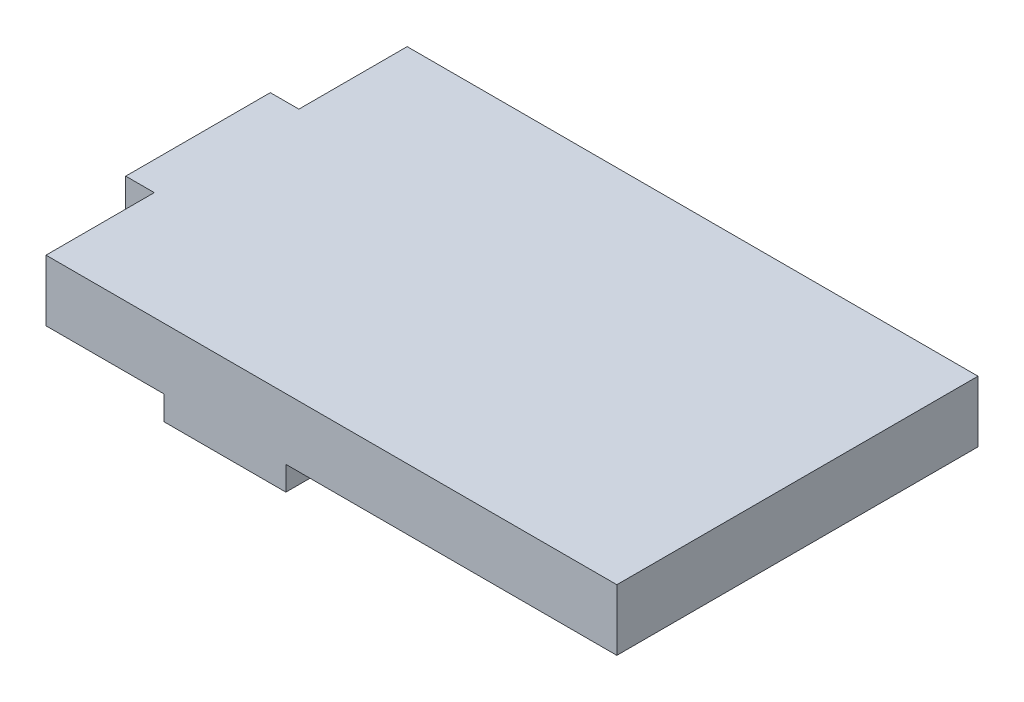
ISO-10303-21;
HEADER;
FILE_DESCRIPTION(('STEP AP214'),'2;1');
FILE_NAME('part.step','',(''),(''),'','','');
FILE_SCHEMA(('AUTOMOTIVE_DESIGN { 1 0 10303 214 1 1 1 1 }'));
ENDSEC;
DATA;
#1=APPLICATION_CONTEXT('core data for automotive mechanical design processes');
#2=APPLICATION_PROTOCOL_DEFINITION('international standard','automotive_design',2000,#1);
#3=PRODUCT_CONTEXT('',#1,'mechanical');
#4=PRODUCT('Part','Part','',(#3));
#5=PRODUCT_RELATED_PRODUCT_CATEGORY('part','',(#4));
#6=PRODUCT_DEFINITION_FORMATION('','',#4);
#7=PRODUCT_DEFINITION_CONTEXT('part definition',#1,'design');
#8=PRODUCT_DEFINITION('design','',#6,#7);
#9=PRODUCT_DEFINITION_SHAPE('','',#8);
#10=(LENGTH_UNIT() NAMED_UNIT(*) SI_UNIT(.MILLI.,.METRE.));
#11=(NAMED_UNIT(*) PLANE_ANGLE_UNIT() SI_UNIT($,.RADIAN.));
#12=(NAMED_UNIT(*) SI_UNIT($,.STERADIAN.) SOLID_ANGLE_UNIT());
#13=UNCERTAINTY_MEASURE_WITH_UNIT(LENGTH_MEASURE(1.E-05),#10,'distance_accuracy_value','');
#14=(GEOMETRIC_REPRESENTATION_CONTEXT(3) GLOBAL_UNCERTAINTY_ASSIGNED_CONTEXT((#13)) GLOBAL_UNIT_ASSIGNED_CONTEXT((#10,
#11,#12)) REPRESENTATION_CONTEXT('',''));
#15=CARTESIAN_POINT('',(0.,0.,0.));
#16=DIRECTION('',(0.,0.,1.));
#17=DIRECTION('',(1.,0.,0.));
#18=AXIS2_PLACEMENT_3D('',#15,#16,#17);
#19=CARTESIAN_POINT('',(0.,5.08,14.986));
#20=DIRECTION('',(0.,0.,-1.));
#21=DIRECTION('',(-1.,0.,0.));
#22=AXIS2_PLACEMENT_3D('',#19,#20,#21);
#23=PLANE('',#22);
#24=DIRECTION('',(1.,0.,0.));
#25=VECTOR('',#24,1.);
#26=CARTESIAN_POINT('',(0.,0.,14.986));
#27=LINE('',#26,#25);
#28=CARTESIAN_POINT('',(0.,0.,14.986));
#29=VERTEX_POINT('',#28);
#30=CARTESIAN_POINT('',(9.8,0.,14.986));
#31=VERTEX_POINT('',#30);
#32=EDGE_CURVE('E157',#29,#31,#27,.T.);
#33=ORIENTED_EDGE('',*,*,#32,.T.);
#34=DIRECTION('',(0.,1.,0.));
#35=VECTOR('',#34,1.);
#36=CARTESIAN_POINT('',(9.8,-2.,14.986));
#37=LINE('',#36,#35);
#38=CARTESIAN_POINT('',(9.8,-2.,14.986));
#39=VERTEX_POINT('',#38);
#40=EDGE_CURVE('E212',#39,#31,#37,.T.);
#41=ORIENTED_EDGE('',*,*,#40,.F.);
#42=DIRECTION('',(1.,0.,0.));
#43=VECTOR('',#42,1.);
#44=CARTESIAN_POINT('',(9.8,-2.,14.986));
#45=LINE('',#44,#43);
#46=CARTESIAN_POINT('',(19.91,-2.,14.986));
#47=VERTEX_POINT('',#46);
#48=EDGE_CURVE('E231',#39,#47,#45,.T.);
#49=ORIENTED_EDGE('',*,*,#48,.T.);
#50=DIRECTION('',(0.,1.,0.));
#51=VECTOR('',#50,1.);
#52=CARTESIAN_POINT('',(19.91,-2.,14.986));
#53=LINE('',#52,#51);
#54=CARTESIAN_POINT('',(19.91,0.,14.986));
#55=VERTEX_POINT('',#54);
#56=EDGE_CURVE('E198',#47,#55,#53,.T.);
#57=ORIENTED_EDGE('',*,*,#56,.T.);
#58=CARTESIAN_POINT('',(47.371,0.,14.986));
#59=VERTEX_POINT('',#58);
#60=EDGE_CURVE('E161',#55,#59,#27,.T.);
#61=ORIENTED_EDGE('',*,*,#60,.T.);
#62=DIRECTION('',(0.,-1.,0.));
#63=VECTOR('',#62,1.);
#64=CARTESIAN_POINT('',(47.371,5.08,14.986));
#65=LINE('',#64,#63);
#66=CARTESIAN_POINT('',(47.371,5.08,14.986));
#67=VERTEX_POINT('',#66);
#68=EDGE_CURVE('E49',#67,#59,#65,.T.);
#69=ORIENTED_EDGE('',*,*,#68,.F.);
#70=DIRECTION('',(1.,0.,0.));
#71=VECTOR('',#70,1.);
#72=CARTESIAN_POINT('',(0.,5.08,14.986));
#73=LINE('',#72,#71);
#74=CARTESIAN_POINT('',(0.,5.08,14.986));
#75=VERTEX_POINT('',#74);
#76=EDGE_CURVE('E194',#75,#67,#73,.T.);
#77=ORIENTED_EDGE('',*,*,#76,.F.);
#78=DIRECTION('',(0.,-1.,0.));
#79=VECTOR('',#78,1.);
#80=CARTESIAN_POINT('',(0.,5.08,14.986));
#81=LINE('',#80,#79);
#82=EDGE_CURVE('E175',#75,#29,#81,.T.);
#83=ORIENTED_EDGE('',*,*,#82,.T.);
#84=EDGE_LOOP('',(#33,#41,#49,#57,#61,#69,#77,#83));
#85=FACE_BOUND('',#84,.T.);
#86=ADVANCED_FACE('F42',(#85),#23,.F.);
#87=CARTESIAN_POINT('',(47.371,5.08,0.));
#88=DIRECTION('',(-1.,0.,0.));
#89=DIRECTION('',(0.,0.,1.));
#90=AXIS2_PLACEMENT_3D('',#87,#88,#89);
#91=PLANE('',#90);
#92=DIRECTION('',(0.,0.,-1.));
#93=VECTOR('',#92,1.);
#94=CARTESIAN_POINT('',(47.371,0.,0.));
#95=LINE('',#94,#93);
#96=CARTESIAN_POINT('',(47.371,0.,-14.986));
#97=VERTEX_POINT('',#96);
#98=EDGE_CURVE('E160',#59,#97,#95,.T.);
#99=ORIENTED_EDGE('',*,*,#98,.T.);
#100=DIRECTION('',(0.,-1.,0.));
#101=VECTOR('',#100,1.);
#102=CARTESIAN_POINT('',(47.371,5.08,-14.986));
#103=LINE('',#102,#101);
#104=CARTESIAN_POINT('',(47.371,5.08,-14.986));
#105=VERTEX_POINT('',#104);
#106=EDGE_CURVE('E183',#105,#97,#103,.T.);
#107=ORIENTED_EDGE('',*,*,#106,.F.);
#108=DIRECTION('',(0.,0.,-1.));
#109=VECTOR('',#108,1.);
#110=CARTESIAN_POINT('',(47.371,5.08,0.));
#111=LINE('',#110,#109);
#112=EDGE_CURVE('E190',#67,#105,#111,.T.);
#113=ORIENTED_EDGE('',*,*,#112,.F.);
#114=ORIENTED_EDGE('',*,*,#68,.T.);
#115=EDGE_LOOP('',(#99,#107,#113,#114));
#116=FACE_BOUND('',#115,.T.);
#117=ADVANCED_FACE('F187',(#116),#91,.F.);
#118=CARTESIAN_POINT('',(0.,5.08,-14.986));
#119=DIRECTION('',(0.,0.,-1.));
#120=DIRECTION('',(-1.,0.,0.));
#121=AXIS2_PLACEMENT_3D('',#118,#119,#120);
#122=PLANE('',#121);
#123=DIRECTION('',(1.,0.,0.));
#124=VECTOR('',#123,1.);
#125=CARTESIAN_POINT('',(0.,0.,-14.986));
#126=LINE('',#125,#124);
#127=CARTESIAN_POINT('',(0.,0.,-14.986));
#128=VERTEX_POINT('',#127);
#129=EDGE_CURVE('E164',#128,#97,#126,.T.);
#130=ORIENTED_EDGE('',*,*,#129,.F.);
#131=DIRECTION('',(0.,-1.,0.));
#132=VECTOR('',#131,1.);
#133=CARTESIAN_POINT('',(0.,5.08,-14.986));
#134=LINE('',#133,#132);
#135=CARTESIAN_POINT('',(0.,5.08,-14.986));
#136=VERTEX_POINT('',#135);
#137=EDGE_CURVE('E181',#136,#128,#134,.T.);
#138=ORIENTED_EDGE('',*,*,#137,.F.);
#139=DIRECTION('',(1.,0.,0.));
#140=VECTOR('',#139,1.);
#141=CARTESIAN_POINT('',(0.,5.08,-14.986));
#142=LINE('',#141,#140);
#143=EDGE_CURVE('E153',#136,#105,#142,.T.);
#144=ORIENTED_EDGE('',*,*,#143,.T.);
#145=ORIENTED_EDGE('',*,*,#106,.T.);
#146=EDGE_LOOP('',(#130,#138,#144,#145));
#147=FACE_BOUND('',#146,.T.);
#148=ADVANCED_FACE('F207',(#147),#122,.T.);
#149=CARTESIAN_POINT('',(0.,5.08,0.));
#150=DIRECTION('',(-1.,0.,0.));
#151=DIRECTION('',(0.,0.,1.));
#152=AXIS2_PLACEMENT_3D('',#149,#150,#151);
#153=PLANE('',#152);
#154=DIRECTION('',(0.,0.,-1.));
#155=VECTOR('',#154,1.);
#156=CARTESIAN_POINT('',(0.,0.,0.));
#157=LINE('',#156,#155);
#158=CARTESIAN_POINT('',(0.,0.,-6.));
#159=VERTEX_POINT('',#158);
#160=EDGE_CURVE('E167',#159,#128,#157,.T.);
#161=ORIENTED_EDGE('',*,*,#160,.F.);
#162=DIRECTION('',(0.,-1.,0.));
#163=VECTOR('',#162,1.);
#164=CARTESIAN_POINT('',(0.,5.08,-6.));
#165=LINE('',#164,#163);
#166=CARTESIAN_POINT('',(0.,5.08,-6.));
#167=VERTEX_POINT('',#166);
#168=EDGE_CURVE('E179',#167,#159,#165,.T.);
#169=ORIENTED_EDGE('',*,*,#168,.F.);
#170=DIRECTION('',(0.,0.,-1.));
#171=VECTOR('',#170,1.);
#172=CARTESIAN_POINT('',(0.,5.08,0.));
#173=LINE('',#172,#171);
#174=EDGE_CURVE('E148',#167,#136,#173,.T.);
#175=ORIENTED_EDGE('',*,*,#174,.T.);
#176=ORIENTED_EDGE('',*,*,#137,.T.);
#177=EDGE_LOOP('',(#161,#169,#175,#176));
#178=FACE_BOUND('',#177,.T.);
#179=ADVANCED_FACE('F272',(#178),#153,.T.);
#180=CARTESIAN_POINT('',(0.,5.08,-6.));
#181=DIRECTION('',(0.,0.,1.));
#182=DIRECTION('',(1.,0.,0.));
#183=AXIS2_PLACEMENT_3D('',#180,#181,#182);
#184=PLANE('',#183);
#185=DIRECTION('',(-1.,0.,0.));
#186=VECTOR('',#185,1.);
#187=CARTESIAN_POINT('',(0.,0.,-6.));
#188=LINE('',#187,#186);
#189=CARTESIAN_POINT('',(-2.37,0.,-6.));
#190=VERTEX_POINT('',#189);
#191=EDGE_CURVE('E143',#159,#190,#188,.T.);
#192=ORIENTED_EDGE('',*,*,#191,.T.);
#193=DIRECTION('',(0.,-1.,0.));
#194=VECTOR('',#193,1.);
#195=CARTESIAN_POINT('',(-2.37,5.08,-5.99999999999999));
#196=LINE('',#195,#194);
#197=CARTESIAN_POINT('',(-2.37,5.08,-5.99999999999999));
#198=VERTEX_POINT('',#197);
#199=EDGE_CURVE('E56',#198,#190,#196,.T.);
#200=ORIENTED_EDGE('',*,*,#199,.F.);
#201=DIRECTION('',(-1.,0.,0.));
#202=VECTOR('',#201,1.);
#203=CARTESIAN_POINT('',(0.,5.08,-6.));
#204=LINE('',#203,#202);
#205=EDGE_CURVE('E140',#167,#198,#204,.T.);
#206=ORIENTED_EDGE('',*,*,#205,.F.);
#207=ORIENTED_EDGE('',*,*,#168,.T.);
#208=EDGE_LOOP('',(#192,#200,#206,#207));
#209=FACE_BOUND('',#208,.T.);
#210=ADVANCED_FACE('F139',(#209),#184,.F.);
#211=CARTESIAN_POINT('',(0.,5.08,6.));
#212=DIRECTION('',(0.,0.,1.));
#213=DIRECTION('',(1.,0.,0.));
#214=AXIS2_PLACEMENT_3D('',#211,#212,#213);
#215=PLANE('',#214);
#216=DIRECTION('',(0.,-1.,0.));
#217=VECTOR('',#216,1.);
#218=CARTESIAN_POINT('',(-2.37,5.08,6.));
#219=LINE('',#218,#217);
#220=CARTESIAN_POINT('',(-2.37,5.08,6.));
#221=VERTEX_POINT('',#220);
#222=CARTESIAN_POINT('',(-2.37,0.,6.));
#223=VERTEX_POINT('',#222);
#224=EDGE_CURVE('E130',#221,#223,#219,.T.);
#225=ORIENTED_EDGE('',*,*,#224,.T.);
#226=DIRECTION('',(-1.,0.,0.));
#227=VECTOR('',#226,1.);
#228=CARTESIAN_POINT('',(0.,0.,6.));
#229=LINE('',#228,#227);
#230=CARTESIAN_POINT('',(0.,0.,6.));
#231=VERTEX_POINT('',#230);
#232=EDGE_CURVE('E172',#231,#223,#229,.T.);
#233=ORIENTED_EDGE('',*,*,#232,.F.);
#234=DIRECTION('',(0.,-1.,0.));
#235=VECTOR('',#234,1.);
#236=CARTESIAN_POINT('',(0.,5.08,6.));
#237=LINE('',#236,#235);
#238=CARTESIAN_POINT('',(0.,5.08,6.));
#239=VERTEX_POINT('',#238);
#240=EDGE_CURVE('E177',#239,#231,#237,.T.);
#241=ORIENTED_EDGE('',*,*,#240,.F.);
#242=DIRECTION('',(-1.,0.,0.));
#243=VECTOR('',#242,1.);
#244=CARTESIAN_POINT('',(0.,5.08,6.));
#245=LINE('',#244,#243);
#246=EDGE_CURVE('E149',#239,#221,#245,.T.);
#247=ORIENTED_EDGE('',*,*,#246,.T.);
#248=EDGE_LOOP('',(#225,#233,#241,#247));
#249=FACE_BOUND('',#248,.T.);
#250=ADVANCED_FACE('F237',(#249),#215,.T.);
#251=EDGE_CURVE('E170',#29,#231,#157,.T.);
#252=ORIENTED_EDGE('',*,*,#251,.F.);
#253=ORIENTED_EDGE('',*,*,#82,.F.);
#254=EDGE_CURVE('E151',#75,#239,#173,.T.);
#255=ORIENTED_EDGE('',*,*,#254,.T.);
#256=ORIENTED_EDGE('',*,*,#240,.T.);
#257=EDGE_LOOP('',(#252,#253,#255,#256));
#258=FACE_BOUND('',#257,.T.);
#259=ADVANCED_FACE('F242',(#258),#153,.T.);
#260=CARTESIAN_POINT('',(0.,5.08,0.));
#261=DIRECTION('',(0.,1.,0.));
#262=DIRECTION('',(0.,0.,1.));
#263=AXIS2_PLACEMENT_3D('',#260,#261,#262);
#264=PLANE('',#263);
#265=DIRECTION('',(0.,0.,1.));
#266=VECTOR('',#265,1.);
#267=CARTESIAN_POINT('',(-2.37,5.08,0.));
#268=LINE('',#267,#266);
#269=EDGE_CURVE('E127',#198,#221,#268,.T.);
#270=ORIENTED_EDGE('',*,*,#269,.T.);
#271=ORIENTED_EDGE('',*,*,#246,.F.);
#272=ORIENTED_EDGE('',*,*,#254,.F.);
#273=ORIENTED_EDGE('',*,*,#76,.T.);
#274=ORIENTED_EDGE('',*,*,#112,.T.);
#275=ORIENTED_EDGE('',*,*,#143,.F.);
#276=ORIENTED_EDGE('',*,*,#174,.F.);
#277=ORIENTED_EDGE('',*,*,#205,.T.);
#278=EDGE_LOOP('',(#270,#271,#272,#273,#274,#275,#276,#277));
#279=FACE_BOUND('',#278,.T.);
#280=ADVANCED_FACE('F145',(#279),#264,.T.);
#281=CARTESIAN_POINT('',(0.,0.,0.));
#282=DIRECTION('',(0.,1.,0.));
#283=DIRECTION('',(0.,0.,1.));
#284=AXIS2_PLACEMENT_3D('',#281,#282,#283);
#285=PLANE('',#284);
#286=ORIENTED_EDGE('',*,*,#232,.T.);
#287=DIRECTION('',(0.,0.,-1.));
#288=VECTOR('',#287,1.);
#289=CARTESIAN_POINT('',(-2.37,0.,0.));
#290=LINE('',#289,#288);
#291=EDGE_CURVE('E11',#223,#190,#290,.T.);
#292=ORIENTED_EDGE('',*,*,#291,.T.);
#293=ORIENTED_EDGE('',*,*,#191,.F.);
#294=ORIENTED_EDGE('',*,*,#160,.T.);
#295=ORIENTED_EDGE('',*,*,#129,.T.);
#296=ORIENTED_EDGE('',*,*,#98,.F.);
#297=ORIENTED_EDGE('',*,*,#60,.F.);
#298=DIRECTION('',(0.,0.,-1.));
#299=VECTOR('',#298,1.);
#300=CARTESIAN_POINT('',(19.91,0.,14.986));
#301=LINE('',#300,#299);
#302=CARTESIAN_POINT('',(19.91,0.,10.356));
#303=VERTEX_POINT('',#302);
#304=EDGE_CURVE('E223',#55,#303,#301,.T.);
#305=ORIENTED_EDGE('',*,*,#304,.T.);
#306=DIRECTION('',(-1.,0.,0.));
#307=VECTOR('',#306,1.);
#308=CARTESIAN_POINT('',(9.8,0.,10.356));
#309=LINE('',#308,#307);
#310=CARTESIAN_POINT('',(9.8,0.,10.356));
#311=VERTEX_POINT('',#310);
#312=EDGE_CURVE('E219',#303,#311,#309,.T.);
#313=ORIENTED_EDGE('',*,*,#312,.T.);
#314=DIRECTION('',(0.,0.,1.));
#315=VECTOR('',#314,1.);
#316=CARTESIAN_POINT('',(9.8,0.,14.986));
#317=LINE('',#316,#315);
#318=EDGE_CURVE('E63',#311,#31,#317,.T.);
#319=ORIENTED_EDGE('',*,*,#318,.T.);
#320=ORIENTED_EDGE('',*,*,#32,.F.);
#321=ORIENTED_EDGE('',*,*,#251,.T.);
#322=EDGE_LOOP('',(#286,#292,#293,#294,#295,#296,#297,#305,#313,#319,#320,#321));
#323=FACE_BOUND('',#322,.T.);
#324=ADVANCED_FACE('F203',(#323),#285,.F.);
#325=CARTESIAN_POINT('',(9.8,-2.,14.986));
#326=DIRECTION('',(-1.,0.,0.));
#327=DIRECTION('',(0.,0.,1.));
#328=AXIS2_PLACEMENT_3D('',#325,#326,#327);
#329=PLANE('',#328);
#330=ORIENTED_EDGE('',*,*,#318,.F.);
#331=DIRECTION('',(0.,1.,0.));
#332=VECTOR('',#331,1.);
#333=CARTESIAN_POINT('',(9.8,-2.,10.356));
#334=LINE('',#333,#332);
#335=CARTESIAN_POINT('',(9.8,-2.,10.356));
#336=VERTEX_POINT('',#335);
#337=EDGE_CURVE('E202',#336,#311,#334,.T.);
#338=ORIENTED_EDGE('',*,*,#337,.F.);
#339=DIRECTION('',(0.,0.,1.));
#340=VECTOR('',#339,1.);
#341=CARTESIAN_POINT('',(9.8,-2.,14.986));
#342=LINE('',#341,#340);
#343=EDGE_CURVE('E222',#336,#39,#342,.T.);
#344=ORIENTED_EDGE('',*,*,#343,.T.);
#345=ORIENTED_EDGE('',*,*,#40,.T.);
#346=EDGE_LOOP('',(#330,#338,#344,#345));
#347=FACE_BOUND('',#346,.T.);
#348=ADVANCED_FACE('F250',(#347),#329,.T.);
#349=CARTESIAN_POINT('',(9.8,-2.,10.356));
#350=DIRECTION('',(0.,0.,-1.));
#351=DIRECTION('',(-1.,0.,0.));
#352=AXIS2_PLACEMENT_3D('',#349,#350,#351);
#353=PLANE('',#352);
#354=ORIENTED_EDGE('',*,*,#312,.F.);
#355=DIRECTION('',(0.,1.,0.));
#356=VECTOR('',#355,1.);
#357=CARTESIAN_POINT('',(19.91,-2.,10.356));
#358=LINE('',#357,#356);
#359=CARTESIAN_POINT('',(19.91,-2.,10.356));
#360=VERTEX_POINT('',#359);
#361=EDGE_CURVE('E216',#360,#303,#358,.T.);
#362=ORIENTED_EDGE('',*,*,#361,.F.);
#363=DIRECTION('',(-1.,0.,0.));
#364=VECTOR('',#363,1.);
#365=CARTESIAN_POINT('',(9.8,-2.,10.356));
#366=LINE('',#365,#364);
#367=EDGE_CURVE('E214',#360,#336,#366,.T.);
#368=ORIENTED_EDGE('',*,*,#367,.T.);
#369=ORIENTED_EDGE('',*,*,#337,.T.);
#370=EDGE_LOOP('',(#354,#362,#368,#369));
#371=FACE_BOUND('',#370,.T.);
#372=ADVANCED_FACE('F253',(#371),#353,.T.);
#373=CARTESIAN_POINT('',(19.91,-2.,14.986));
#374=DIRECTION('',(1.,0.,0.));
#375=DIRECTION('',(0.,0.,-1.));
#376=AXIS2_PLACEMENT_3D('',#373,#374,#375);
#377=PLANE('',#376);
#378=ORIENTED_EDGE('',*,*,#304,.F.);
#379=ORIENTED_EDGE('',*,*,#56,.F.);
#380=DIRECTION('',(0.,0.,-1.));
#381=VECTOR('',#380,1.);
#382=CARTESIAN_POINT('',(19.91,-2.,14.986));
#383=LINE('',#382,#381);
#384=EDGE_CURVE('E228',#47,#360,#383,.T.);
#385=ORIENTED_EDGE('',*,*,#384,.T.);
#386=ORIENTED_EDGE('',*,*,#361,.T.);
#387=EDGE_LOOP('',(#378,#379,#385,#386));
#388=FACE_BOUND('',#387,.T.);
#389=ADVANCED_FACE('F255',(#388),#377,.T.);
#390=CARTESIAN_POINT('',(0.,-2.,0.));
#391=DIRECTION('',(0.,-1.,0.));
#392=DIRECTION('',(0.,0.,-1.));
#393=AXIS2_PLACEMENT_3D('',#390,#391,#392);
#394=PLANE('',#393);
#395=ORIENTED_EDGE('',*,*,#343,.F.);
#396=ORIENTED_EDGE('',*,*,#367,.F.);
#397=ORIENTED_EDGE('',*,*,#384,.F.);
#398=ORIENTED_EDGE('',*,*,#48,.F.);
#399=EDGE_LOOP('',(#395,#396,#397,#398));
#400=FACE_BOUND('',#399,.T.);
#401=ADVANCED_FACE('F248',(#400),#394,.T.);
#402=CARTESIAN_POINT('',(-2.37,5.08,0.));
#403=DIRECTION('',(1.,0.,0.));
#404=DIRECTION('',(0.,0.,-1.));
#405=AXIS2_PLACEMENT_3D('',#402,#403,#404);
#406=PLANE('',#405);
#407=ORIENTED_EDGE('',*,*,#224,.F.);
#408=ORIENTED_EDGE('',*,*,#269,.F.);
#409=ORIENTED_EDGE('',*,*,#199,.T.);
#410=ORIENTED_EDGE('',*,*,#291,.F.);
#411=EDGE_LOOP('',(#407,#408,#409,#410));
#412=FACE_BOUND('',#411,.T.);
#413=ADVANCED_FACE('F128',(#412),#406,.F.);
#414=CLOSED_SHELL('',(#86,#117,#148,#179,#210,#250,#259,#280,#324,#348,#372,#389,#401,#413));
#415=MANIFOLD_SOLID_BREP('B2',#414);
#416=ADVANCED_BREP_SHAPE_REPRESENTATION('',(#18,#415),#14);
#417=SHAPE_DEFINITION_REPRESENTATION(#9,#416);
ENDSEC;
END-ISO-10303-21;
